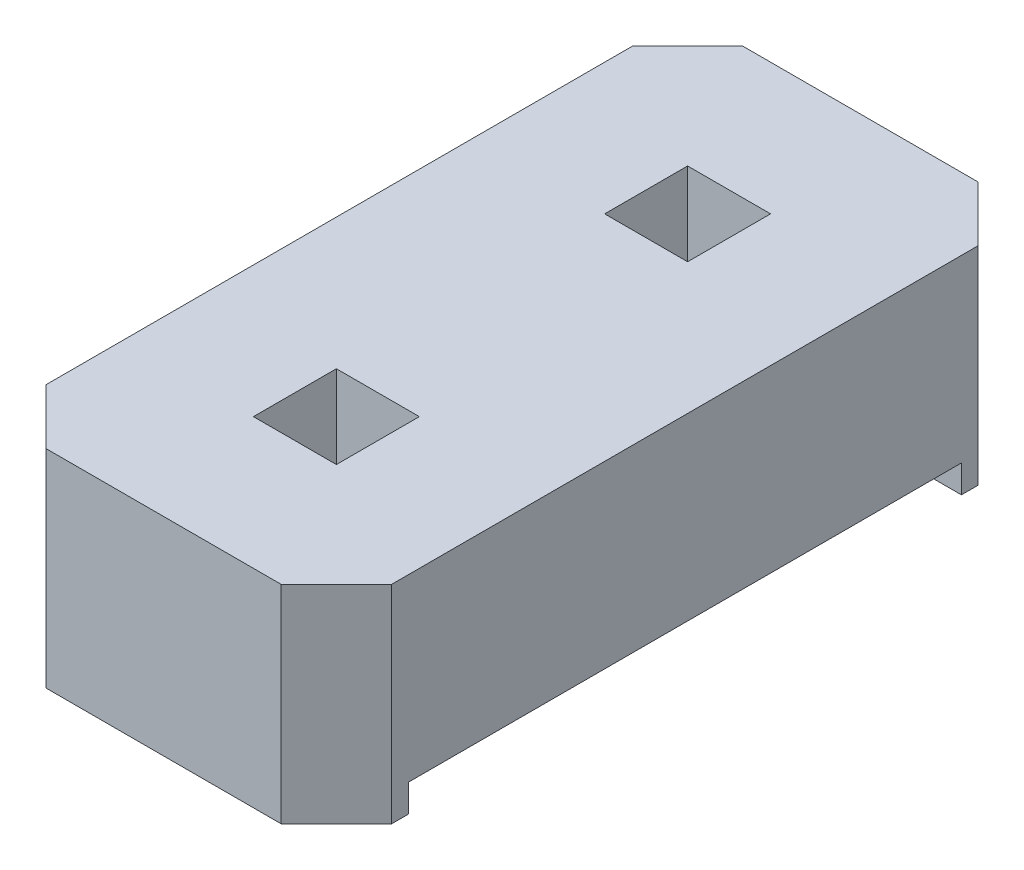
ISO-10303-21;
HEADER;
FILE_DESCRIPTION(('STEP AP214'),'2;1');
FILE_NAME('part.step','',(''),(''),'','','');
FILE_SCHEMA(('AUTOMOTIVE_DESIGN { 1 0 10303 214 1 1 1 1 }'));
ENDSEC;
DATA;
#1=APPLICATION_CONTEXT('core data for automotive mechanical design processes');
#2=APPLICATION_PROTOCOL_DEFINITION('international standard','automotive_design',2000,#1);
#3=PRODUCT_CONTEXT('',#1,'mechanical');
#4=PRODUCT('Part','Part','',(#3));
#5=PRODUCT_RELATED_PRODUCT_CATEGORY('part','',(#4));
#6=PRODUCT_DEFINITION_FORMATION('','',#4);
#7=PRODUCT_DEFINITION_CONTEXT('part definition',#1,'design');
#8=PRODUCT_DEFINITION('design','',#6,#7);
#9=PRODUCT_DEFINITION_SHAPE('','',#8);
#10=(LENGTH_UNIT() NAMED_UNIT(*) SI_UNIT(.MILLI.,.METRE.));
#11=(NAMED_UNIT(*) PLANE_ANGLE_UNIT() SI_UNIT($,.RADIAN.));
#12=(NAMED_UNIT(*) SI_UNIT($,.STERADIAN.) SOLID_ANGLE_UNIT());
#13=UNCERTAINTY_MEASURE_WITH_UNIT(LENGTH_MEASURE(1.E-05),#10,'distance_accuracy_value','');
#14=(GEOMETRIC_REPRESENTATION_CONTEXT(3) GLOBAL_UNCERTAINTY_ASSIGNED_CONTEXT((#13)) GLOBAL_UNIT_ASSIGNED_CONTEXT((#10,
#11,#12)) REPRESENTATION_CONTEXT('',''));
#15=CARTESIAN_POINT('',(0.,0.,0.));
#16=DIRECTION('',(0.,0.,1.));
#17=DIRECTION('',(1.,0.,0.));
#18=AXIS2_PLACEMENT_3D('',#15,#16,#17);
#19=CARTESIAN_POINT('',(0.,0.,0.));
#20=DIRECTION('',(0.,-1.,0.));
#21=DIRECTION('',(0.,0.,-1.));
#22=AXIS2_PLACEMENT_3D('',#19,#20,#21);
#23=PLANE('',#22);
#24=DIRECTION('',(-1.,0.,0.));
#25=VECTOR('',#24,1.);
#26=CARTESIAN_POINT('',(0.,0.,2.));
#27=LINE('',#26,#25);
#28=CARTESIAN_POINT('',(1.25,0.,2.));
#29=VERTEX_POINT('',#28);
#30=CARTESIAN_POINT('',(-1.25,0.,2.));
#31=VERTEX_POINT('',#30);
#32=EDGE_CURVE('E339',#29,#31,#27,.T.);
#33=ORIENTED_EDGE('',*,*,#32,.F.);
#34=DIRECTION('',(0.,0.,-1.));
#35=VECTOR('',#34,1.);
#36=CARTESIAN_POINT('',(1.25,0.,2.12));
#37=LINE('',#36,#35);
#38=CARTESIAN_POINT('',(1.25,0.,2.12));
#39=VERTEX_POINT('',#38);
#40=EDGE_CURVE('E189',#39,#29,#37,.T.);
#41=ORIENTED_EDGE('',*,*,#40,.F.);
#42=DIRECTION('',(0.707106781186547,0.,-0.707106781186548));
#43=VECTOR('',#42,1.);
#44=CARTESIAN_POINT('',(0.850000000000001,0.,2.52));
#45=LINE('',#44,#43);
#46=CARTESIAN_POINT('',(0.850000000000001,0.,2.52));
#47=VERTEX_POINT('',#46);
#48=EDGE_CURVE('E200',#47,#39,#45,.T.);
#49=ORIENTED_EDGE('',*,*,#48,.F.);
#50=DIRECTION('',(1.,0.,0.));
#51=VECTOR('',#50,1.);
#52=CARTESIAN_POINT('',(-0.85,0.,2.52));
#53=LINE('',#52,#51);
#54=CARTESIAN_POINT('',(-0.85,0.,2.52));
#55=VERTEX_POINT('',#54);
#56=EDGE_CURVE('E306',#55,#47,#53,.T.);
#57=ORIENTED_EDGE('',*,*,#56,.F.);
#58=DIRECTION('',(0.707106781186547,0.,0.707106781186548));
#59=VECTOR('',#58,1.);
#60=CARTESIAN_POINT('',(-1.25,0.,2.12));
#61=LINE('',#60,#59);
#62=CARTESIAN_POINT('',(-1.25,0.,2.12));
#63=VERTEX_POINT('',#62);
#64=EDGE_CURVE('E305',#63,#55,#61,.T.);
#65=ORIENTED_EDGE('',*,*,#64,.F.);
#66=DIRECTION('',(0.,0.,1.));
#67=VECTOR('',#66,1.);
#68=CARTESIAN_POINT('',(-1.25,0.,2.12));
#69=LINE('',#68,#67);
#70=EDGE_CURVE('E286',#31,#63,#69,.T.);
#71=ORIENTED_EDGE('',*,*,#70,.F.);
#72=EDGE_LOOP('',(#33,#41,#49,#57,#65,#71));
#73=FACE_BOUND('',#72,.T.);
#74=ADVANCED_FACE('F32',(#73),#23,.T.);
#75=CARTESIAN_POINT('',(0.,1.5,0.));
#76=DIRECTION('',(0.,-1.,0.));
#77=DIRECTION('',(0.,0.,-1.));
#78=AXIS2_PLACEMENT_3D('',#75,#76,#77);
#79=PLANE('',#78);
#80=DIRECTION('',(0.,0.,1.));
#81=VECTOR('',#80,1.);
#82=CARTESIAN_POINT('',(-0.3,1.5,0.97));
#83=LINE('',#82,#81);
#84=CARTESIAN_POINT('',(-0.3,1.5,0.97));
#85=VERTEX_POINT('',#84);
#86=CARTESIAN_POINT('',(-0.3,1.5,1.57));
#87=VERTEX_POINT('',#86);
#88=EDGE_CURVE('E265',#85,#87,#83,.T.);
#89=ORIENTED_EDGE('',*,*,#88,.F.);
#90=DIRECTION('',(-1.,0.,0.));
#91=VECTOR('',#90,1.);
#92=CARTESIAN_POINT('',(0.3,1.5,0.97));
#93=LINE('',#92,#91);
#94=CARTESIAN_POINT('',(0.3,1.5,0.97));
#95=VERTEX_POINT('',#94);
#96=EDGE_CURVE('E272',#95,#85,#93,.T.);
#97=ORIENTED_EDGE('',*,*,#96,.F.);
#98=DIRECTION('',(0.,0.,-1.));
#99=VECTOR('',#98,1.);
#100=CARTESIAN_POINT('',(0.3,1.5,0.97));
#101=LINE('',#100,#99);
#102=CARTESIAN_POINT('',(0.3,1.5,1.57));
#103=VERTEX_POINT('',#102);
#104=EDGE_CURVE('E269',#103,#95,#101,.T.);
#105=ORIENTED_EDGE('',*,*,#104,.F.);
#106=DIRECTION('',(1.,0.,0.));
#107=VECTOR('',#106,1.);
#108=CARTESIAN_POINT('',(0.3,1.5,1.57));
#109=LINE('',#108,#107);
#110=EDGE_CURVE('E267',#87,#103,#109,.T.);
#111=ORIENTED_EDGE('',*,*,#110,.F.);
#112=EDGE_LOOP('',(#89,#97,#105,#111));
#113=FACE_BOUND('',#112,.T.);
#114=DIRECTION('',(0.,0.,1.));
#115=VECTOR('',#114,1.);
#116=CARTESIAN_POINT('',(-1.25,1.5,2.12));
#117=LINE('',#116,#115);
#118=CARTESIAN_POINT('',(-1.25,1.5,-2.12));
#119=VERTEX_POINT('',#118);
#120=CARTESIAN_POINT('',(-1.25,1.5,2.12));
#121=VERTEX_POINT('',#120);
#122=EDGE_CURVE('E207',#119,#121,#117,.T.);
#123=ORIENTED_EDGE('',*,*,#122,.T.);
#124=DIRECTION('',(0.707106781186547,0.,0.707106781186548));
#125=VECTOR('',#124,1.);
#126=CARTESIAN_POINT('',(-1.25,1.5,2.12));
#127=LINE('',#126,#125);
#128=CARTESIAN_POINT('',(-0.85,1.5,2.52));
#129=VERTEX_POINT('',#128);
#130=EDGE_CURVE('E289',#121,#129,#127,.T.);
#131=ORIENTED_EDGE('',*,*,#130,.T.);
#132=DIRECTION('',(1.,0.,0.));
#133=VECTOR('',#132,1.);
#134=CARTESIAN_POINT('',(-0.85,1.5,2.52));
#135=LINE('',#134,#133);
#136=CARTESIAN_POINT('',(0.850000000000001,1.5,2.52));
#137=VERTEX_POINT('',#136);
#138=EDGE_CURVE('E291',#129,#137,#135,.T.);
#139=ORIENTED_EDGE('',*,*,#138,.T.);
#140=DIRECTION('',(0.707106781186547,0.,-0.707106781186548));
#141=VECTOR('',#140,1.);
#142=CARTESIAN_POINT('',(0.850000000000001,1.5,2.52));
#143=LINE('',#142,#141);
#144=CARTESIAN_POINT('',(1.25,1.5,2.12));
#145=VERTEX_POINT('',#144);
#146=EDGE_CURVE('E293',#137,#145,#143,.T.);
#147=ORIENTED_EDGE('',*,*,#146,.T.);
#148=DIRECTION('',(0.,0.,-1.));
#149=VECTOR('',#148,1.);
#150=CARTESIAN_POINT('',(1.25,1.5,2.12));
#151=LINE('',#150,#149);
#152=CARTESIAN_POINT('',(1.25,1.5,-2.12));
#153=VERTEX_POINT('',#152);
#154=EDGE_CURVE('E295',#145,#153,#151,.T.);
#155=ORIENTED_EDGE('',*,*,#154,.T.);
#156=DIRECTION('',(-0.707106781186547,0.,-0.707106781186548));
#157=VECTOR('',#156,1.);
#158=CARTESIAN_POINT('',(0.85,1.5,-2.52));
#159=LINE('',#158,#157);
#160=CARTESIAN_POINT('',(0.85,1.5,-2.52));
#161=VERTEX_POINT('',#160);
#162=EDGE_CURVE('E297',#153,#161,#159,.T.);
#163=ORIENTED_EDGE('',*,*,#162,.T.);
#164=DIRECTION('',(-1.,0.,0.));
#165=VECTOR('',#164,1.);
#166=CARTESIAN_POINT('',(-0.85,1.5,-2.52));
#167=LINE('',#166,#165);
#168=CARTESIAN_POINT('',(-0.85,1.5,-2.52));
#169=VERTEX_POINT('',#168);
#170=EDGE_CURVE('E299',#161,#169,#167,.T.);
#171=ORIENTED_EDGE('',*,*,#170,.T.);
#172=DIRECTION('',(-0.707106781186547,0.,0.707106781186548));
#173=VECTOR('',#172,1.);
#174=CARTESIAN_POINT('',(-1.25,1.5,-2.12));
#175=LINE('',#174,#173);
#176=EDGE_CURVE('E212',#169,#119,#175,.T.);
#177=ORIENTED_EDGE('',*,*,#176,.T.);
#178=EDGE_LOOP('',(#123,#131,#139,#147,#155,#163,#171,#177));
#179=FACE_BOUND('',#178,.T.);
#180=DIRECTION('',(1.,0.,0.));
#181=VECTOR('',#180,1.);
#182=CARTESIAN_POINT('',(0.3,1.5,-0.97));
#183=LINE('',#182,#181);
#184=CARTESIAN_POINT('',(-0.3,1.5,-0.97));
#185=VERTEX_POINT('',#184);
#186=CARTESIAN_POINT('',(0.3,1.5,-0.97));
#187=VERTEX_POINT('',#186);
#188=EDGE_CURVE('E341',#185,#187,#183,.T.);
#189=ORIENTED_EDGE('',*,*,#188,.F.);
#190=DIRECTION('',(0.,0.,1.));
#191=VECTOR('',#190,1.);
#192=CARTESIAN_POINT('',(-0.3,1.5,-0.97));
#193=LINE('',#192,#191);
#194=CARTESIAN_POINT('',(-0.3,1.5,-1.57));
#195=VERTEX_POINT('',#194);
#196=EDGE_CURVE('E253',#195,#185,#193,.T.);
#197=ORIENTED_EDGE('',*,*,#196,.F.);
#198=DIRECTION('',(-1.,0.,0.));
#199=VECTOR('',#198,1.);
#200=CARTESIAN_POINT('',(0.3,1.5,-1.57));
#201=LINE('',#200,#199);
#202=CARTESIAN_POINT('',(0.3,1.5,-1.57));
#203=VERTEX_POINT('',#202);
#204=EDGE_CURVE('E258',#203,#195,#201,.T.);
#205=ORIENTED_EDGE('',*,*,#204,.F.);
#206=DIRECTION('',(0.,0.,-1.));
#207=VECTOR('',#206,1.);
#208=CARTESIAN_POINT('',(0.3,1.5,-0.97));
#209=LINE('',#208,#207);
#210=EDGE_CURVE('E343',#187,#203,#209,.T.);
#211=ORIENTED_EDGE('',*,*,#210,.F.);
#212=EDGE_LOOP('',(#189,#197,#205,#211));
#213=FACE_BOUND('',#212,.T.);
#214=ADVANCED_FACE('F351',(#113,#179,#213),#79,.F.);
#215=DIRECTION('',(1.,0.,0.));
#216=VECTOR('',#215,1.);
#217=CARTESIAN_POINT('',(0.,0.,-2.));
#218=LINE('',#217,#216);
#219=CARTESIAN_POINT('',(-1.25,0.,-2.));
#220=VERTEX_POINT('',#219);
#221=CARTESIAN_POINT('',(1.25,0.,-2.));
#222=VERTEX_POINT('',#221);
#223=EDGE_CURVE('E337',#220,#222,#218,.T.);
#224=ORIENTED_EDGE('',*,*,#223,.F.);
#225=CARTESIAN_POINT('',(-1.25,0.,-2.12));
#226=VERTEX_POINT('',#225);
#227=EDGE_CURVE('E302',#226,#220,#69,.T.);
#228=ORIENTED_EDGE('',*,*,#227,.F.);
#229=DIRECTION('',(-0.707106781186547,0.,0.707106781186548));
#230=VECTOR('',#229,1.);
#231=CARTESIAN_POINT('',(-1.25,0.,-2.12));
#232=LINE('',#231,#230);
#233=CARTESIAN_POINT('',(-0.85,0.,-2.52));
#234=VERTEX_POINT('',#233);
#235=EDGE_CURVE('E205',#234,#226,#232,.T.);
#236=ORIENTED_EDGE('',*,*,#235,.F.);
#237=DIRECTION('',(-1.,0.,0.));
#238=VECTOR('',#237,1.);
#239=CARTESIAN_POINT('',(-0.85,0.,-2.52));
#240=LINE('',#239,#238);
#241=CARTESIAN_POINT('',(0.85,0.,-2.52));
#242=VERTEX_POINT('',#241);
#243=EDGE_CURVE('E198',#242,#234,#240,.T.);
#244=ORIENTED_EDGE('',*,*,#243,.F.);
#245=DIRECTION('',(-0.707106781186547,0.,-0.707106781186548));
#246=VECTOR('',#245,1.);
#247=CARTESIAN_POINT('',(0.85,0.,-2.52));
#248=LINE('',#247,#246);
#249=CARTESIAN_POINT('',(1.25,0.,-2.12));
#250=VERTEX_POINT('',#249);
#251=EDGE_CURVE('E195',#250,#242,#248,.T.);
#252=ORIENTED_EDGE('',*,*,#251,.F.);
#253=EDGE_CURVE('E196',#222,#250,#37,.T.);
#254=ORIENTED_EDGE('',*,*,#253,.F.);
#255=EDGE_LOOP('',(#224,#228,#236,#244,#252,#254));
#256=FACE_BOUND('',#255,.T.);
#257=ADVANCED_FACE('F365',(#256),#23,.T.);
#258=CARTESIAN_POINT('',(-1.25,1.5,2.12));
#259=DIRECTION('',(1.,0.,0.));
#260=DIRECTION('',(0.,0.,-1.));
#261=AXIS2_PLACEMENT_3D('',#258,#259,#260);
#262=PLANE('',#261);
#263=DIRECTION('',(0.,0.,-1.));
#264=VECTOR('',#263,1.);
#265=CARTESIAN_POINT('',(-1.25,0.2,-2.));
#266=LINE('',#265,#264);
#267=CARTESIAN_POINT('',(-1.25,0.2,2.));
#268=VERTEX_POINT('',#267);
#269=CARTESIAN_POINT('',(-1.25,0.2,-2.));
#270=VERTEX_POINT('',#269);
#271=EDGE_CURVE('E322',#268,#270,#266,.T.);
#272=ORIENTED_EDGE('',*,*,#271,.F.);
#273=DIRECTION('',(0.,1.,0.));
#274=VECTOR('',#273,1.);
#275=CARTESIAN_POINT('',(-1.25,-0.2,2.));
#276=LINE('',#275,#274);
#277=EDGE_CURVE('E173',#31,#268,#276,.T.);
#278=ORIENTED_EDGE('',*,*,#277,.F.);
#279=ORIENTED_EDGE('',*,*,#70,.T.);
#280=DIRECTION('',(0.,-1.,0.));
#281=VECTOR('',#280,1.);
#282=CARTESIAN_POINT('',(-1.25,1.5,2.12));
#283=LINE('',#282,#281);
#284=EDGE_CURVE('E228',#121,#63,#283,.T.);
#285=ORIENTED_EDGE('',*,*,#284,.F.);
#286=ORIENTED_EDGE('',*,*,#122,.F.);
#287=DIRECTION('',(0.,-1.,0.));
#288=VECTOR('',#287,1.);
#289=CARTESIAN_POINT('',(-1.25,1.5,-2.12));
#290=LINE('',#289,#288);
#291=EDGE_CURVE('E208',#119,#226,#290,.T.);
#292=ORIENTED_EDGE('',*,*,#291,.T.);
#293=ORIENTED_EDGE('',*,*,#227,.T.);
#294=DIRECTION('',(0.,-1.,0.));
#295=VECTOR('',#294,1.);
#296=CARTESIAN_POINT('',(-1.25,-0.2,-2.));
#297=LINE('',#296,#295);
#298=EDGE_CURVE('E183',#270,#220,#297,.T.);
#299=ORIENTED_EDGE('',*,*,#298,.F.);
#300=EDGE_LOOP('',(#272,#278,#279,#285,#286,#292,#293,#299));
#301=FACE_BOUND('',#300,.T.);
#302=ADVANCED_FACE('F34',(#301),#262,.F.);
#303=CARTESIAN_POINT('',(-1.25,1.5,2.12));
#304=DIRECTION('',(0.707106781186548,0.,-0.707106781186547));
#305=DIRECTION('',(-0.707106781186547,0.,-0.707106781186548));
#306=AXIS2_PLACEMENT_3D('',#303,#304,#305);
#307=PLANE('',#306);
#308=ORIENTED_EDGE('',*,*,#64,.T.);
#309=DIRECTION('',(0.,-1.,0.));
#310=VECTOR('',#309,1.);
#311=CARTESIAN_POINT('',(-0.85,1.5,2.52));
#312=LINE('',#311,#310);
#313=EDGE_CURVE('E225',#129,#55,#312,.T.);
#314=ORIENTED_EDGE('',*,*,#313,.F.);
#315=ORIENTED_EDGE('',*,*,#130,.F.);
#316=ORIENTED_EDGE('',*,*,#284,.T.);
#317=EDGE_LOOP('',(#308,#314,#315,#316));
#318=FACE_BOUND('',#317,.T.);
#319=ADVANCED_FACE('F318',(#318),#307,.F.);
#320=CARTESIAN_POINT('',(-0.85,1.5,2.52));
#321=DIRECTION('',(0.,0.,-1.));
#322=DIRECTION('',(-1.,0.,0.));
#323=AXIS2_PLACEMENT_3D('',#320,#321,#322);
#324=PLANE('',#323);
#325=ORIENTED_EDGE('',*,*,#56,.T.);
#326=DIRECTION('',(0.,-1.,0.));
#327=VECTOR('',#326,1.);
#328=CARTESIAN_POINT('',(0.850000000000001,1.5,2.52));
#329=LINE('',#328,#327);
#330=EDGE_CURVE('E222',#137,#47,#329,.T.);
#331=ORIENTED_EDGE('',*,*,#330,.F.);
#332=ORIENTED_EDGE('',*,*,#138,.F.);
#333=ORIENTED_EDGE('',*,*,#313,.T.);
#334=EDGE_LOOP('',(#325,#331,#332,#333));
#335=FACE_BOUND('',#334,.T.);
#336=ADVANCED_FACE('F398',(#335),#324,.F.);
#337=CARTESIAN_POINT('',(0.850000000000001,1.5,2.52));
#338=DIRECTION('',(-0.707106781186548,0.,-0.707106781186547));
#339=DIRECTION('',(-0.707106781186547,0.,0.707106781186548));
#340=AXIS2_PLACEMENT_3D('',#337,#338,#339);
#341=PLANE('',#340);
#342=ORIENTED_EDGE('',*,*,#48,.T.);
#343=DIRECTION('',(0.,-1.,0.));
#344=VECTOR('',#343,1.);
#345=CARTESIAN_POINT('',(1.25,1.5,2.12));
#346=LINE('',#345,#344);
#347=EDGE_CURVE('E192',#145,#39,#346,.T.);
#348=ORIENTED_EDGE('',*,*,#347,.F.);
#349=ORIENTED_EDGE('',*,*,#146,.F.);
#350=ORIENTED_EDGE('',*,*,#330,.T.);
#351=EDGE_LOOP('',(#342,#348,#349,#350));
#352=FACE_BOUND('',#351,.T.);
#353=ADVANCED_FACE('F311',(#352),#341,.F.);
#354=CARTESIAN_POINT('',(1.25,1.5,2.12));
#355=DIRECTION('',(-1.,0.,0.));
#356=DIRECTION('',(0.,0.,1.));
#357=AXIS2_PLACEMENT_3D('',#354,#355,#356);
#358=PLANE('',#357);
#359=ORIENTED_EDGE('',*,*,#40,.T.);
#360=DIRECTION('',(0.,1.,0.));
#361=VECTOR('',#360,1.);
#362=CARTESIAN_POINT('',(1.25,1.5,2.));
#363=LINE('',#362,#361);
#364=CARTESIAN_POINT('',(1.25,0.2,2.));
#365=VERTEX_POINT('',#364);
#366=EDGE_CURVE('E11',#29,#365,#363,.T.);
#367=ORIENTED_EDGE('',*,*,#366,.T.);
#368=DIRECTION('',(0.,0.,-1.));
#369=VECTOR('',#368,1.);
#370=CARTESIAN_POINT('',(1.25,0.2,-2.));
#371=LINE('',#370,#369);
#372=CARTESIAN_POINT('',(1.25,0.2,-2.));
#373=VERTEX_POINT('',#372);
#374=EDGE_CURVE('E180',#365,#373,#371,.T.);
#375=ORIENTED_EDGE('',*,*,#374,.T.);
#376=DIRECTION('',(0.,-1.,0.));
#377=VECTOR('',#376,1.);
#378=CARTESIAN_POINT('',(1.25,-0.2,-2.));
#379=LINE('',#378,#377);
#380=EDGE_CURVE('E47',#373,#222,#379,.T.);
#381=ORIENTED_EDGE('',*,*,#380,.T.);
#382=ORIENTED_EDGE('',*,*,#253,.T.);
#383=DIRECTION('',(0.,-1.,0.));
#384=VECTOR('',#383,1.);
#385=CARTESIAN_POINT('',(1.25,1.5,-2.12));
#386=LINE('',#385,#384);
#387=EDGE_CURVE('E218',#153,#250,#386,.T.);
#388=ORIENTED_EDGE('',*,*,#387,.F.);
#389=ORIENTED_EDGE('',*,*,#154,.F.);
#390=ORIENTED_EDGE('',*,*,#347,.T.);
#391=EDGE_LOOP('',(#359,#367,#375,#381,#382,#388,#389,#390));
#392=FACE_BOUND('',#391,.T.);
#393=ADVANCED_FACE('F186',(#392),#358,.F.);
#394=CARTESIAN_POINT('',(0.85,1.5,-2.52));
#395=DIRECTION('',(-0.707106781186548,0.,0.707106781186547));
#396=DIRECTION('',(0.707106781186547,0.,0.707106781186548));
#397=AXIS2_PLACEMENT_3D('',#394,#395,#396);
#398=PLANE('',#397);
#399=ORIENTED_EDGE('',*,*,#251,.T.);
#400=DIRECTION('',(0.,-1.,0.));
#401=VECTOR('',#400,1.);
#402=CARTESIAN_POINT('',(0.85,1.5,-2.52));
#403=LINE('',#402,#401);
#404=EDGE_CURVE('E215',#161,#242,#403,.T.);
#405=ORIENTED_EDGE('',*,*,#404,.F.);
#406=ORIENTED_EDGE('',*,*,#162,.F.);
#407=ORIENTED_EDGE('',*,*,#387,.T.);
#408=EDGE_LOOP('',(#399,#405,#406,#407));
#409=FACE_BOUND('',#408,.T.);
#410=ADVANCED_FACE('F394',(#409),#398,.F.);
#411=CARTESIAN_POINT('',(-0.85,1.5,-2.52));
#412=DIRECTION('',(0.,0.,1.));
#413=DIRECTION('',(1.,0.,0.));
#414=AXIS2_PLACEMENT_3D('',#411,#412,#413);
#415=PLANE('',#414);
#416=ORIENTED_EDGE('',*,*,#243,.T.);
#417=DIRECTION('',(0.,-1.,0.));
#418=VECTOR('',#417,1.);
#419=CARTESIAN_POINT('',(-0.85,1.5,-2.52));
#420=LINE('',#419,#418);
#421=EDGE_CURVE('E211',#169,#234,#420,.T.);
#422=ORIENTED_EDGE('',*,*,#421,.F.);
#423=ORIENTED_EDGE('',*,*,#170,.F.);
#424=ORIENTED_EDGE('',*,*,#404,.T.);
#425=EDGE_LOOP('',(#416,#422,#423,#424));
#426=FACE_BOUND('',#425,.T.);
#427=ADVANCED_FACE('F389',(#426),#415,.F.);
#428=CARTESIAN_POINT('',(-1.25,1.5,-2.12));
#429=DIRECTION('',(0.707106781186548,0.,0.707106781186547));
#430=DIRECTION('',(0.707106781186547,0.,-0.707106781186548));
#431=AXIS2_PLACEMENT_3D('',#428,#429,#430);
#432=PLANE('',#431);
#433=ORIENTED_EDGE('',*,*,#235,.T.);
#434=ORIENTED_EDGE('',*,*,#291,.F.);
#435=ORIENTED_EDGE('',*,*,#176,.F.);
#436=ORIENTED_EDGE('',*,*,#421,.T.);
#437=EDGE_LOOP('',(#433,#434,#435,#436));
#438=FACE_BOUND('',#437,.T.);
#439=ADVANCED_FACE('F385',(#438),#432,.F.);
#440=CARTESIAN_POINT('',(-0.3,1.5,0.97));
#441=DIRECTION('',(1.,0.,0.));
#442=DIRECTION('',(0.,0.,-1.));
#443=AXIS2_PLACEMENT_3D('',#440,#441,#442);
#444=PLANE('',#443);
#445=DIRECTION('',(0.,0.,1.));
#446=VECTOR('',#445,1.);
#447=CARTESIAN_POINT('',(-0.3,0.2,0.97));
#448=LINE('',#447,#446);
#449=CARTESIAN_POINT('',(-0.3,0.2,0.97));
#450=VERTEX_POINT('',#449);
#451=CARTESIAN_POINT('',(-0.3,0.2,1.57));
#452=VERTEX_POINT('',#451);
#453=EDGE_CURVE('E335',#450,#452,#448,.T.);
#454=ORIENTED_EDGE('',*,*,#453,.F.);
#455=DIRECTION('',(0.,-1.,0.));
#456=VECTOR('',#455,1.);
#457=CARTESIAN_POINT('',(-0.3,1.5,0.97));
#458=LINE('',#457,#456);
#459=EDGE_CURVE('E274',#85,#450,#458,.T.);
#460=ORIENTED_EDGE('',*,*,#459,.F.);
#461=ORIENTED_EDGE('',*,*,#88,.T.);
#462=DIRECTION('',(0.,-1.,0.));
#463=VECTOR('',#462,1.);
#464=CARTESIAN_POINT('',(-0.3,1.5,1.57));
#465=LINE('',#464,#463);
#466=EDGE_CURVE('E283',#87,#452,#465,.T.);
#467=ORIENTED_EDGE('',*,*,#466,.T.);
#468=EDGE_LOOP('',(#454,#460,#461,#467));
#469=FACE_BOUND('',#468,.T.);
#470=ADVANCED_FACE('F413',(#469),#444,.T.);
#471=CARTESIAN_POINT('',(0.3,1.5,1.57));
#472=DIRECTION('',(0.,0.,-1.));
#473=DIRECTION('',(-1.,0.,0.));
#474=AXIS2_PLACEMENT_3D('',#471,#472,#473);
#475=PLANE('',#474);
#476=DIRECTION('',(1.,0.,0.));
#477=VECTOR('',#476,1.);
#478=CARTESIAN_POINT('',(0.3,0.2,1.57));
#479=LINE('',#478,#477);
#480=CARTESIAN_POINT('',(0.3,0.2,1.57));
#481=VERTEX_POINT('',#480);
#482=EDGE_CURVE('E333',#452,#481,#479,.T.);
#483=ORIENTED_EDGE('',*,*,#482,.F.);
#484=ORIENTED_EDGE('',*,*,#466,.F.);
#485=ORIENTED_EDGE('',*,*,#110,.T.);
#486=DIRECTION('',(0.,-1.,0.));
#487=VECTOR('',#486,1.);
#488=CARTESIAN_POINT('',(0.3,1.5,1.57));
#489=LINE('',#488,#487);
#490=EDGE_CURVE('E280',#103,#481,#489,.T.);
#491=ORIENTED_EDGE('',*,*,#490,.T.);
#492=EDGE_LOOP('',(#483,#484,#485,#491));
#493=FACE_BOUND('',#492,.T.);
#494=ADVANCED_FACE('F417',(#493),#475,.T.);
#495=CARTESIAN_POINT('',(0.3,1.5,0.97));
#496=DIRECTION('',(-1.,0.,0.));
#497=DIRECTION('',(0.,0.,1.));
#498=AXIS2_PLACEMENT_3D('',#495,#496,#497);
#499=PLANE('',#498);
#500=DIRECTION('',(0.,0.,-1.));
#501=VECTOR('',#500,1.);
#502=CARTESIAN_POINT('',(0.3,0.2,0.97));
#503=LINE('',#502,#501);
#504=CARTESIAN_POINT('',(0.3,0.2,0.97));
#505=VERTEX_POINT('',#504);
#506=EDGE_CURVE('E55',#481,#505,#503,.T.);
#507=ORIENTED_EDGE('',*,*,#506,.F.);
#508=ORIENTED_EDGE('',*,*,#490,.F.);
#509=ORIENTED_EDGE('',*,*,#104,.T.);
#510=DIRECTION('',(0.,-1.,0.));
#511=VECTOR('',#510,1.);
#512=CARTESIAN_POINT('',(0.3,1.5,0.97));
#513=LINE('',#512,#511);
#514=EDGE_CURVE('E277',#95,#505,#513,.T.);
#515=ORIENTED_EDGE('',*,*,#514,.T.);
#516=EDGE_LOOP('',(#507,#508,#509,#515));
#517=FACE_BOUND('',#516,.T.);
#518=ADVANCED_FACE('F423',(#517),#499,.T.);
#519=CARTESIAN_POINT('',(0.3,1.5,0.97));
#520=DIRECTION('',(0.,0.,1.));
#521=DIRECTION('',(1.,0.,0.));
#522=AXIS2_PLACEMENT_3D('',#519,#520,#521);
#523=PLANE('',#522);
#524=DIRECTION('',(-1.,0.,0.));
#525=VECTOR('',#524,1.);
#526=CARTESIAN_POINT('',(0.3,0.2,0.97));
#527=LINE('',#526,#525);
#528=EDGE_CURVE('E248',#505,#450,#527,.T.);
#529=ORIENTED_EDGE('',*,*,#528,.F.);
#530=ORIENTED_EDGE('',*,*,#514,.F.);
#531=ORIENTED_EDGE('',*,*,#96,.T.);
#532=ORIENTED_EDGE('',*,*,#459,.T.);
#533=EDGE_LOOP('',(#529,#530,#531,#532));
#534=FACE_BOUND('',#533,.T.);
#535=ADVANCED_FACE('F361',(#534),#523,.T.);
#536=CARTESIAN_POINT('',(0.3,1.5,-0.97));
#537=DIRECTION('',(0.,0.,-1.));
#538=DIRECTION('',(-1.,0.,0.));
#539=AXIS2_PLACEMENT_3D('',#536,#537,#538);
#540=PLANE('',#539);
#541=DIRECTION('',(1.,0.,0.));
#542=VECTOR('',#541,1.);
#543=CARTESIAN_POINT('',(0.3,0.2,-0.97));
#544=LINE('',#543,#542);
#545=CARTESIAN_POINT('',(-0.3,0.2,-0.97));
#546=VERTEX_POINT('',#545);
#547=CARTESIAN_POINT('',(0.3,0.2,-0.97));
#548=VERTEX_POINT('',#547);
#549=EDGE_CURVE('E233',#546,#548,#544,.T.);
#550=ORIENTED_EDGE('',*,*,#549,.F.);
#551=DIRECTION('',(0.,-1.,0.));
#552=VECTOR('',#551,1.);
#553=CARTESIAN_POINT('',(-0.3,1.5,-0.97));
#554=LINE('',#553,#552);
#555=EDGE_CURVE('E244',#185,#546,#554,.T.);
#556=ORIENTED_EDGE('',*,*,#555,.F.);
#557=ORIENTED_EDGE('',*,*,#188,.T.);
#558=DIRECTION('',(0.,-1.,0.));
#559=VECTOR('',#558,1.);
#560=CARTESIAN_POINT('',(0.3,1.5,-0.97));
#561=LINE('',#560,#559);
#562=EDGE_CURVE('E247',#187,#548,#561,.T.);
#563=ORIENTED_EDGE('',*,*,#562,.T.);
#564=EDGE_LOOP('',(#550,#556,#557,#563));
#565=FACE_BOUND('',#564,.T.);
#566=ADVANCED_FACE('F243',(#565),#540,.T.);
#567=CARTESIAN_POINT('',(0.3,1.5,-0.97));
#568=DIRECTION('',(-1.,0.,0.));
#569=DIRECTION('',(0.,0.,1.));
#570=AXIS2_PLACEMENT_3D('',#567,#568,#569);
#571=PLANE('',#570);
#572=DIRECTION('',(0.,0.,-1.));
#573=VECTOR('',#572,1.);
#574=CARTESIAN_POINT('',(0.3,0.2,-0.97));
#575=LINE('',#574,#573);
#576=CARTESIAN_POINT('',(0.3,0.2,-1.57));
#577=VERTEX_POINT('',#576);
#578=EDGE_CURVE('E249',#548,#577,#575,.T.);
#579=ORIENTED_EDGE('',*,*,#578,.F.);
#580=ORIENTED_EDGE('',*,*,#562,.F.);
#581=ORIENTED_EDGE('',*,*,#210,.T.);
#582=DIRECTION('',(0.,-1.,0.));
#583=VECTOR('',#582,1.);
#584=CARTESIAN_POINT('',(0.3,1.5,-1.57));
#585=LINE('',#584,#583);
#586=EDGE_CURVE('E256',#203,#577,#585,.T.);
#587=ORIENTED_EDGE('',*,*,#586,.T.);
#588=EDGE_LOOP('',(#579,#580,#581,#587));
#589=FACE_BOUND('',#588,.T.);
#590=ADVANCED_FACE('F353',(#589),#571,.T.);
#591=CARTESIAN_POINT('',(0.3,1.5,-1.57));
#592=DIRECTION('',(0.,0.,1.));
#593=DIRECTION('',(1.,0.,0.));
#594=AXIS2_PLACEMENT_3D('',#591,#592,#593);
#595=PLANE('',#594);
#596=DIRECTION('',(-1.,0.,0.));
#597=VECTOR('',#596,1.);
#598=CARTESIAN_POINT('',(0.3,0.2,-1.57));
#599=LINE('',#598,#597);
#600=CARTESIAN_POINT('',(-0.3,0.2,-1.57));
#601=VERTEX_POINT('',#600);
#602=EDGE_CURVE('E236',#577,#601,#599,.T.);
#603=ORIENTED_EDGE('',*,*,#602,.F.);
#604=ORIENTED_EDGE('',*,*,#586,.F.);
#605=ORIENTED_EDGE('',*,*,#204,.T.);
#606=DIRECTION('',(0.,-1.,0.));
#607=VECTOR('',#606,1.);
#608=CARTESIAN_POINT('',(-0.3,1.5,-1.57));
#609=LINE('',#608,#607);
#610=EDGE_CURVE('E254',#195,#601,#609,.T.);
#611=ORIENTED_EDGE('',*,*,#610,.T.);
#612=EDGE_LOOP('',(#603,#604,#605,#611));
#613=FACE_BOUND('',#612,.T.);
#614=ADVANCED_FACE('F348',(#613),#595,.T.);
#615=CARTESIAN_POINT('',(-0.3,1.5,-0.97));
#616=DIRECTION('',(1.,0.,0.));
#617=DIRECTION('',(0.,0.,-1.));
#618=AXIS2_PLACEMENT_3D('',#615,#616,#617);
#619=PLANE('',#618);
#620=DIRECTION('',(0.,0.,1.));
#621=VECTOR('',#620,1.);
#622=CARTESIAN_POINT('',(-0.3,0.2,-0.97));
#623=LINE('',#622,#621);
#624=EDGE_CURVE('E40',#601,#546,#623,.T.);
#625=ORIENTED_EDGE('',*,*,#624,.F.);
#626=ORIENTED_EDGE('',*,*,#610,.F.);
#627=ORIENTED_EDGE('',*,*,#196,.T.);
#628=ORIENTED_EDGE('',*,*,#555,.T.);
#629=EDGE_LOOP('',(#625,#626,#627,#628));
#630=FACE_BOUND('',#629,.T.);
#631=ADVANCED_FACE('F251',(#630),#619,.T.);
#632=CARTESIAN_POINT('',(1.25,-0.2,2.));
#633=DIRECTION('',(0.,0.,1.));
#634=DIRECTION('',(1.,0.,0.));
#635=AXIS2_PLACEMENT_3D('',#632,#633,#634);
#636=PLANE('',#635);
#637=ORIENTED_EDGE('',*,*,#32,.T.);
#638=ORIENTED_EDGE('',*,*,#277,.T.);
#639=DIRECTION('',(-1.,0.,0.));
#640=VECTOR('',#639,1.);
#641=CARTESIAN_POINT('',(1.25,0.2,2.));
#642=LINE('',#641,#640);
#643=EDGE_CURVE('E168',#365,#268,#642,.T.);
#644=ORIENTED_EDGE('',*,*,#643,.F.);
#645=ORIENTED_EDGE('',*,*,#366,.F.);
#646=EDGE_LOOP('',(#637,#638,#644,#645));
#647=FACE_BOUND('',#646,.T.);
#648=ADVANCED_FACE('F170',(#647),#636,.F.);
#649=CARTESIAN_POINT('',(1.25,-0.2,-2.));
#650=DIRECTION('',(0.,0.,-1.));
#651=DIRECTION('',(-1.,0.,0.));
#652=AXIS2_PLACEMENT_3D('',#649,#650,#651);
#653=PLANE('',#652);
#654=ORIENTED_EDGE('',*,*,#223,.T.);
#655=ORIENTED_EDGE('',*,*,#380,.F.);
#656=DIRECTION('',(-1.,0.,0.));
#657=VECTOR('',#656,1.);
#658=CARTESIAN_POINT('',(1.25,0.2,-2.));
#659=LINE('',#658,#657);
#660=EDGE_CURVE('E177',#373,#270,#659,.T.);
#661=ORIENTED_EDGE('',*,*,#660,.T.);
#662=ORIENTED_EDGE('',*,*,#298,.T.);
#663=EDGE_LOOP('',(#654,#655,#661,#662));
#664=FACE_BOUND('',#663,.T.);
#665=ADVANCED_FACE('F444',(#664),#653,.F.);
#666=CARTESIAN_POINT('',(1.25,0.2,-2.));
#667=DIRECTION('',(0.,1.,0.));
#668=DIRECTION('',(0.,0.,1.));
#669=AXIS2_PLACEMENT_3D('',#666,#667,#668);
#670=PLANE('',#669);
#671=ORIENTED_EDGE('',*,*,#453,.T.);
#672=ORIENTED_EDGE('',*,*,#482,.T.);
#673=ORIENTED_EDGE('',*,*,#506,.T.);
#674=ORIENTED_EDGE('',*,*,#528,.T.);
#675=EDGE_LOOP('',(#671,#672,#673,#674));
#676=FACE_BOUND('',#675,.T.);
#677=ORIENTED_EDGE('',*,*,#549,.T.);
#678=ORIENTED_EDGE('',*,*,#578,.T.);
#679=ORIENTED_EDGE('',*,*,#602,.T.);
#680=ORIENTED_EDGE('',*,*,#624,.T.);
#681=EDGE_LOOP('',(#677,#678,#679,#680));
#682=FACE_BOUND('',#681,.T.);
#683=ORIENTED_EDGE('',*,*,#271,.T.);
#684=ORIENTED_EDGE('',*,*,#660,.F.);
#685=ORIENTED_EDGE('',*,*,#374,.F.);
#686=ORIENTED_EDGE('',*,*,#643,.T.);
#687=EDGE_LOOP('',(#683,#684,#685,#686));
#688=FACE_BOUND('',#687,.T.);
#689=ADVANCED_FACE('F181',(#676,#682,#688),#670,.F.);
#690=CLOSED_SHELL('',(#74,#214,#257,#302,#319,#336,#353,#393,#410,#427,#439,#470,#494,#518,#535,
#566,#590,#614,#631,#648,#665,#689));
#691=MANIFOLD_SOLID_BREP('B2',#690);
#692=ADVANCED_BREP_SHAPE_REPRESENTATION('',(#18,#691),#14);
#693=SHAPE_DEFINITION_REPRESENTATION(#9,#692);
ENDSEC;
END-ISO-10303-21;
